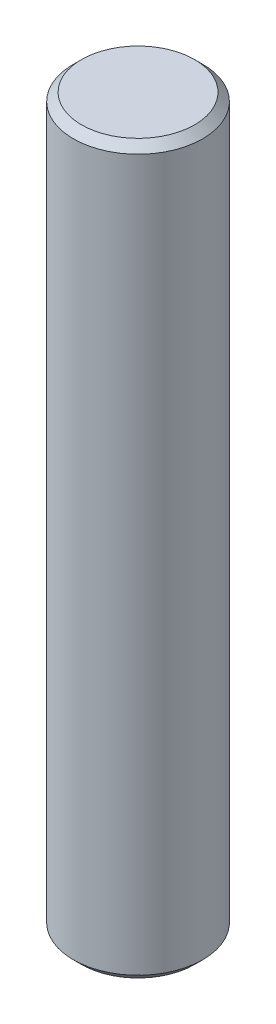
ISO-10303-21;
HEADER;
FILE_DESCRIPTION(('STEP AP214'),'2;1');
FILE_NAME('part.step','',(''),(''),'','','');
FILE_SCHEMA(('AUTOMOTIVE_DESIGN { 1 0 10303 214 1 1 1 1 }'));
ENDSEC;
DATA;
#1=APPLICATION_CONTEXT('core data for automotive mechanical design processes');
#2=APPLICATION_PROTOCOL_DEFINITION('international standard','automotive_design',2000,#1);
#3=PRODUCT_CONTEXT('',#1,'mechanical');
#4=PRODUCT('Part','Part','',(#3));
#5=PRODUCT_RELATED_PRODUCT_CATEGORY('part','',(#4));
#6=PRODUCT_DEFINITION_FORMATION('','',#4);
#7=PRODUCT_DEFINITION_CONTEXT('part definition',#1,'design');
#8=PRODUCT_DEFINITION('design','',#6,#7);
#9=PRODUCT_DEFINITION_SHAPE('','',#8);
#10=(LENGTH_UNIT() NAMED_UNIT(*) SI_UNIT(.MILLI.,.METRE.));
#11=(NAMED_UNIT(*) PLANE_ANGLE_UNIT() SI_UNIT($,.RADIAN.));
#12=(NAMED_UNIT(*) SI_UNIT($,.STERADIAN.) SOLID_ANGLE_UNIT());
#13=UNCERTAINTY_MEASURE_WITH_UNIT(LENGTH_MEASURE(1.E-05),#10,'distance_accuracy_value','');
#14=(GEOMETRIC_REPRESENTATION_CONTEXT(3) GLOBAL_UNCERTAINTY_ASSIGNED_CONTEXT((#13)) GLOBAL_UNIT_ASSIGNED_CONTEXT((#10,
#11,#12)) REPRESENTATION_CONTEXT('',''));
#15=CARTESIAN_POINT('',(0.,0.,0.));
#16=DIRECTION('',(0.,0.,1.));
#17=DIRECTION('',(1.,0.,0.));
#18=AXIS2_PLACEMENT_3D('',#15,#16,#17);
#19=CARTESIAN_POINT('',(25.,33.4999999999511,6.));
#20=DIRECTION('',(0.,-1.,0.));
#21=DIRECTION('',(1.,0.,0.));
#22=AXIS2_PLACEMENT_3D('',#19,#20,#21);
#23=CONICAL_SURFACE('',#22,4.00000000001615,0.785398163397452);
#24=CARTESIAN_POINT('',(25.,33.9999999999145,6.));
#25=DIRECTION('',(0.,-1.,0.));
#26=DIRECTION('',(1.,0.,0.));
#27=AXIS2_PLACEMENT_3D('',#24,#25,#26);
#28=CIRCLE('',#27,3.50000000005275);
#29=CARTESIAN_POINT('',(28.5000000000528,33.9999999999145,6.));
#30=VERTEX_POINT('',#29);
#31=EDGE_CURVE('E42',#30,#30,#28,.T.);
#32=ORIENTED_EDGE('',*,*,#31,.T.);
#33=EDGE_LOOP('',(#32));
#34=FACE_BOUND('',#33,.T.);
#35=CARTESIAN_POINT('',(25.,33.4999999999511,6.));
#36=DIRECTION('',(0.,-1.,0.));
#37=DIRECTION('',(1.,0.,0.));
#38=AXIS2_PLACEMENT_3D('',#35,#36,#37);
#39=CIRCLE('',#38,4.00000000001615);
#40=CARTESIAN_POINT('',(29.0000000000161,33.4999999999511,6.));
#41=VERTEX_POINT('',#40);
#42=EDGE_CURVE('E10',#41,#41,#39,.T.);
#43=ORIENTED_EDGE('',*,*,#42,.F.);
#44=EDGE_LOOP('',(#43));
#45=FACE_BOUND('',#44,.T.);
#46=ADVANCED_FACE('F28',(#34,#45),#23,.T.);
#47=CARTESIAN_POINT('',(25.,33.9999999999145,6.));
#48=DIRECTION('',(0.,-1.,0.));
#49=DIRECTION('',(1.,0.,0.));
#50=AXIS2_PLACEMENT_3D('',#47,#48,#49);
#51=CYLINDRICAL_SURFACE('',#50,4.00000000001615);
#52=ORIENTED_EDGE('',*,*,#42,.T.);
#53=EDGE_LOOP('',(#52));
#54=FACE_BOUND('',#53,.T.);
#55=CARTESIAN_POINT('',(25.,-10.5000000000489,6.));
#56=DIRECTION('',(0.,-1.,0.));
#57=DIRECTION('',(1.,0.,0.));
#58=AXIS2_PLACEMENT_3D('',#55,#56,#57);
#59=CIRCLE('',#58,4.00000000001614);
#60=CARTESIAN_POINT('',(29.0000000000161,-10.5000000000489,6.));
#61=VERTEX_POINT('',#60);
#62=EDGE_CURVE('E34',#61,#61,#59,.T.);
#63=ORIENTED_EDGE('',*,*,#62,.F.);
#64=EDGE_LOOP('',(#63));
#65=FACE_BOUND('',#64,.T.);
#66=ADVANCED_FACE('F61',(#54,#65),#51,.T.);
#67=CARTESIAN_POINT('',(25.,-11.,6.));
#68=DIRECTION('',(0.,1.,0.));
#69=DIRECTION('',(-1.,0.,0.));
#70=AXIS2_PLACEMENT_3D('',#67,#68,#69);
#71=CONICAL_SURFACE('',#70,3.50000000006503,0.785398163397455);
#72=ORIENTED_EDGE('',*,*,#62,.T.);
#73=EDGE_LOOP('',(#72));
#74=FACE_BOUND('',#73,.T.);
#75=CARTESIAN_POINT('',(25.,-11.,6.));
#76=DIRECTION('',(0.,-1.,0.));
#77=DIRECTION('',(1.,0.,0.));
#78=AXIS2_PLACEMENT_3D('',#75,#76,#77);
#79=CIRCLE('',#78,3.50000000006503);
#80=CARTESIAN_POINT('',(28.500000000065,-11.,6.));
#81=VERTEX_POINT('',#80);
#82=EDGE_CURVE('E38',#81,#81,#79,.T.);
#83=ORIENTED_EDGE('',*,*,#82,.F.);
#84=EDGE_LOOP('',(#83));
#85=FACE_BOUND('',#84,.T.);
#86=ADVANCED_FACE('F57',(#74,#85),#71,.T.);
#87=CARTESIAN_POINT('',(25.,-11.,6.));
#88=DIRECTION('',(0.,-1.,0.));
#89=DIRECTION('',(1.,0.,0.));
#90=AXIS2_PLACEMENT_3D('',#87,#88,#89);
#91=PLANE('',#90);
#92=ORIENTED_EDGE('',*,*,#82,.T.);
#93=EDGE_LOOP('',(#92));
#94=FACE_BOUND('',#93,.T.);
#95=ADVANCED_FACE('F52',(#94),#91,.T.);
#96=CARTESIAN_POINT('',(28.5000000000528,33.9999999999145,6.));
#97=DIRECTION('',(0.,1.,0.));
#98=DIRECTION('',(-1.,0.,0.));
#99=AXIS2_PLACEMENT_3D('',#96,#97,#98);
#100=PLANE('',#99);
#101=ORIENTED_EDGE('',*,*,#31,.F.);
#102=EDGE_LOOP('',(#101));
#103=FACE_BOUND('',#102,.T.);
#104=ADVANCED_FACE('F50',(#103),#100,.T.);
#105=CLOSED_SHELL('',(#46,#66,#86,#95,#104));
#106=MANIFOLD_SOLID_BREP('B2',#105);
#107=ADVANCED_BREP_SHAPE_REPRESENTATION('',(#18,#106),#14);
#108=SHAPE_DEFINITION_REPRESENTATION(#9,#107);
ENDSEC;
END-ISO-10303-21;
